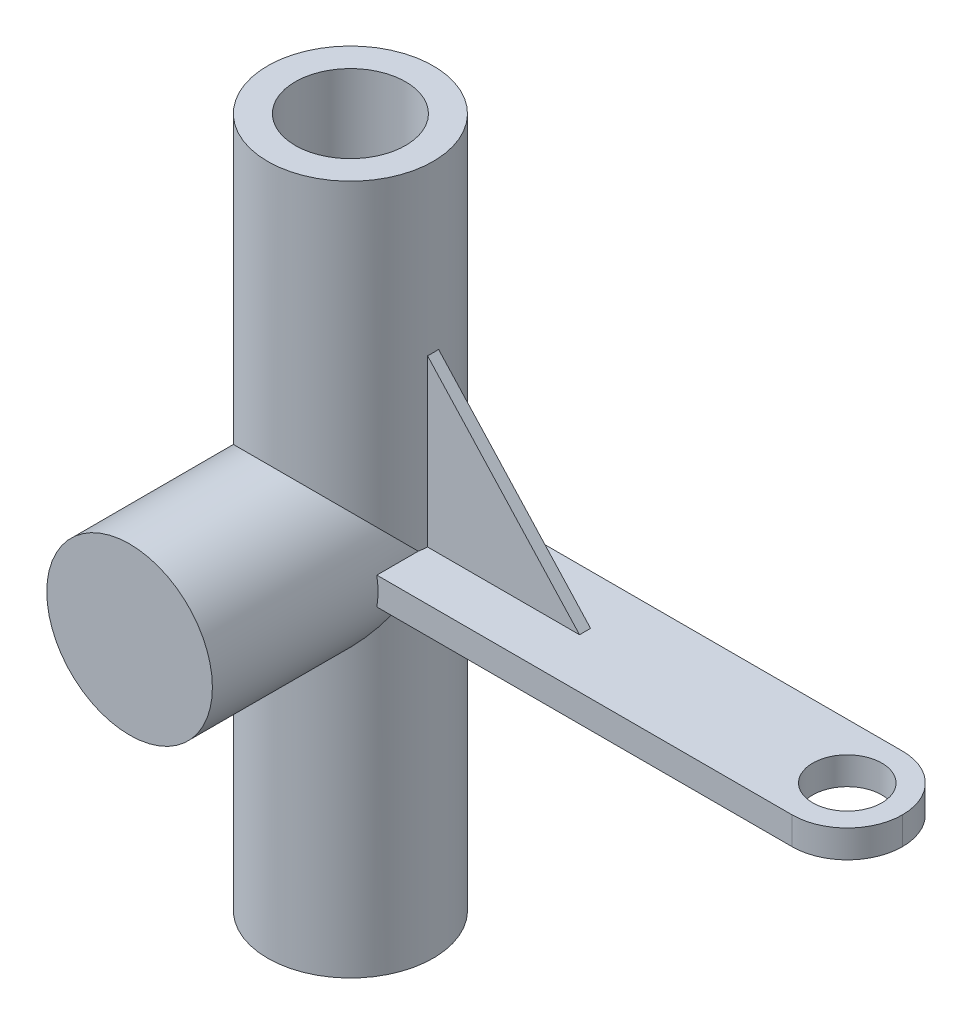
ISO-10303-21;
HEADER;
FILE_DESCRIPTION(('STEP AP214'),'2;1');
FILE_NAME('part.step','',(''),(''),'','','');
FILE_SCHEMA(('AUTOMOTIVE_DESIGN { 1 0 10303 214 1 1 1 1 }'));
ENDSEC;
DATA;
#1=APPLICATION_CONTEXT('core data for automotive mechanical design processes');
#2=APPLICATION_PROTOCOL_DEFINITION('international standard','automotive_design',2000,#1);
#3=PRODUCT_CONTEXT('',#1,'mechanical');
#4=PRODUCT('Part','Part','',(#3));
#5=PRODUCT_RELATED_PRODUCT_CATEGORY('part','',(#4));
#6=PRODUCT_DEFINITION_FORMATION('','',#4);
#7=PRODUCT_DEFINITION_CONTEXT('part definition',#1,'design');
#8=PRODUCT_DEFINITION('design','',#6,#7);
#9=PRODUCT_DEFINITION_SHAPE('','',#8);
#10=(LENGTH_UNIT() NAMED_UNIT(*) SI_UNIT(.MILLI.,.METRE.));
#11=(NAMED_UNIT(*) PLANE_ANGLE_UNIT() SI_UNIT($,.RADIAN.));
#12=(NAMED_UNIT(*) SI_UNIT($,.STERADIAN.) SOLID_ANGLE_UNIT());
#13=UNCERTAINTY_MEASURE_WITH_UNIT(LENGTH_MEASURE(1.E-05),#10,'distance_accuracy_value','');
#14=(GEOMETRIC_REPRESENTATION_CONTEXT(3) GLOBAL_UNCERTAINTY_ASSIGNED_CONTEXT((#13)) GLOBAL_UNIT_ASSIGNED_CONTEXT((#10,
#11,#12)) REPRESENTATION_CONTEXT('',''));
#15=CARTESIAN_POINT('',(0.,0.,0.));
#16=DIRECTION('',(0.,0.,1.));
#17=DIRECTION('',(1.,0.,0.));
#18=AXIS2_PLACEMENT_3D('',#15,#16,#17);
#19=CARTESIAN_POINT('',(0.,125.,0.));
#20=DIRECTION('',(0.,-1.,0.));
#21=DIRECTION('',(0.,0.,-1.));
#22=AXIS2_PLACEMENT_3D('',#19,#20,#21);
#23=CYLINDRICAL_SURFACE('',#22,15.);
#24=CARTESIAN_POINT('',(0.,0.,0.));
#25=DIRECTION('',(0.,1.,0.));
#26=DIRECTION('',(0.,0.,1.));
#27=AXIS2_PLACEMENT_3D('',#24,#25,#26);
#28=CIRCLE('',#27,15.);
#29=CARTESIAN_POINT('',(0.,0.,15.));
#30=VERTEX_POINT('',#29);
#31=EDGE_CURVE('E248',#30,#30,#28,.T.);
#32=ORIENTED_EDGE('',*,*,#31,.T.);
#33=EDGE_LOOP('',(#32));
#34=FACE_BOUND('',#33,.T.);
#35=CARTESIAN_POINT('',(0.,125.,0.));
#36=DIRECTION('',(0.,1.,0.));
#37=DIRECTION('',(0.,0.,1.));
#38=AXIS2_PLACEMENT_3D('',#35,#36,#37);
#39=CIRCLE('',#38,15.);
#40=CARTESIAN_POINT('',(0.,125.,15.));
#41=VERTEX_POINT('',#40);
#42=EDGE_CURVE('E252',#41,#41,#39,.T.);
#43=ORIENTED_EDGE('',*,*,#42,.F.);
#44=EDGE_LOOP('',(#43));
#45=FACE_BOUND('',#44,.T.);
#46=DIRECTION('',(0.,-1.,0.));
#47=VECTOR('',#46,1.);
#48=CARTESIAN_POINT('',(14.9666295470958,125.,-0.999999999999997));
#49=LINE('',#48,#47);
#50=CARTESIAN_POINT('',(14.9666295470958,65.,-0.999999999999997));
#51=VERTEX_POINT('',#50);
#52=CARTESIAN_POINT('',(14.9666295470958,95.,-0.999999999999997));
#53=VERTEX_POINT('',#52);
#54=EDGE_CURVE('E158',#51,#53,#49,.F.);
#55=ORIENTED_EDGE('',*,*,#54,.F.);
#56=CARTESIAN_POINT('',(0.,65.,0.));
#57=DIRECTION('',(0.,-1.,0.));
#58=DIRECTION('',(0.,0.,-1.));
#59=AXIS2_PLACEMENT_3D('',#56,#57,#58);
#60=CIRCLE('',#59,15.);
#61=CARTESIAN_POINT('',(11.180339887499,65.,-10.));
#62=VERTEX_POINT('',#61);
#63=EDGE_CURVE('E165',#62,#51,#60,.T.);
#64=ORIENTED_EDGE('',*,*,#63,.F.);
#65=DIRECTION('',(0.,-1.,0.));
#66=VECTOR('',#65,1.);
#67=CARTESIAN_POINT('',(11.180339887499,125.,-10.));
#68=LINE('',#67,#66);
#69=CARTESIAN_POINT('',(11.180339887499,60.,-10.));
#70=VERTEX_POINT('',#69);
#71=EDGE_CURVE('E223',#70,#62,#68,.F.);
#72=ORIENTED_EDGE('',*,*,#71,.F.);
#73=CARTESIAN_POINT('',(0.,60.,0.));
#74=DIRECTION('',(0.,1.,0.));
#75=DIRECTION('',(0.,0.,1.));
#76=AXIS2_PLACEMENT_3D('',#73,#74,#75);
#77=CIRCLE('',#76,15.);
#78=CARTESIAN_POINT('',(14.7901994577491,60.,2.5));
#79=VERTEX_POINT('',#78);
#80=EDGE_CURVE('E211',#79,#70,#77,.T.);
#81=ORIENTED_EDGE('',*,*,#80,.F.);
#82=CARTESIAN_POINT('',(0.,62.5,0.));
#83=DIRECTION('',(0.,-0.707106781186547,-0.707106781186547));
#84=DIRECTION('',(0.,-0.707106781186547,0.707106781186547));
#85=AXIS2_PLACEMENT_3D('',#82,#83,#84);
#86=ELLIPSE('',#85,21.2132034355964,15.);
#87=CARTESIAN_POINT('',(-15.,62.5,0.));
#88=VERTEX_POINT('',#87);
#89=EDGE_CURVE('E239',#88,#79,#86,.F.);
#90=ORIENTED_EDGE('',*,*,#89,.F.);
#91=CARTESIAN_POINT('',(0.,62.5,0.));
#92=DIRECTION('',(0.,-0.707106781186547,0.707106781186547));
#93=DIRECTION('',(0.,-0.707106781186547,-0.707106781186547));
#94=AXIS2_PLACEMENT_3D('',#91,#92,#93);
#95=ELLIPSE('',#94,21.2132034355964,15.);
#96=CARTESIAN_POINT('',(14.7901994577491,65.,2.5));
#97=VERTEX_POINT('',#96);
#98=EDGE_CURVE('E232',#97,#88,#95,.T.);
#99=ORIENTED_EDGE('',*,*,#98,.F.);
#100=CARTESIAN_POINT('',(14.9666295470958,65.,1.));
#101=VERTEX_POINT('',#100);
#102=EDGE_CURVE('E201',#101,#97,#60,.T.);
#103=ORIENTED_EDGE('',*,*,#102,.F.);
#104=DIRECTION('',(0.,-1.,0.));
#105=VECTOR('',#104,1.);
#106=CARTESIAN_POINT('',(14.9666295470958,125.,1.));
#107=LINE('',#106,#105);
#108=CARTESIAN_POINT('',(14.9666295470958,95.,1.));
#109=VERTEX_POINT('',#108);
#110=EDGE_CURVE('E151',#109,#101,#107,.T.);
#111=ORIENTED_EDGE('',*,*,#110,.F.);
#112=CARTESIAN_POINT('',(0.,95.,0.));
#113=DIRECTION('',(0.,-1.,0.));
#114=DIRECTION('',(0.,0.,-1.));
#115=AXIS2_PLACEMENT_3D('',#112,#113,#114);
#116=CIRCLE('',#115,15.);
#117=EDGE_CURVE('E11',#53,#109,#116,.T.);
#118=ORIENTED_EDGE('',*,*,#117,.F.);
#119=EDGE_LOOP('',(#55,#64,#72,#81,#90,#99,#103,#111,#118));
#120=FACE_BOUND('',#119,.T.);
#121=ADVANCED_FACE('F41',(#34,#45,#120),#23,.T.);
#122=CARTESIAN_POINT('',(100.,65.,10.));
#123=DIRECTION('',(0.,-1.,0.));
#124=DIRECTION('',(0.,0.,-1.));
#125=AXIS2_PLACEMENT_3D('',#122,#123,#124);
#126=PLANE('',#125);
#127=CARTESIAN_POINT('',(90.,65.,0.));
#128=DIRECTION('',(0.,1.,0.));
#129=DIRECTION('',(0.,0.,1.));
#130=AXIS2_PLACEMENT_3D('',#127,#128,#129);
#131=CIRCLE('',#130,6.25);
#132=CARTESIAN_POINT('',(90.,65.,6.25));
#133=VERTEX_POINT('',#132);
#134=EDGE_CURVE('E627',#133,#133,#131,.T.);
#135=ORIENTED_EDGE('',*,*,#134,.F.);
#136=EDGE_LOOP('',(#135));
#137=FACE_BOUND('',#136,.T.);
#138=DIRECTION('',(0.,0.,-1.));
#139=VECTOR('',#138,1.);
#140=CARTESIAN_POINT('',(42.5,65.,-0.999999999999997));
#141=LINE('',#140,#139);
#142=CARTESIAN_POINT('',(42.5,65.,1.));
#143=VERTEX_POINT('',#142);
#144=CARTESIAN_POINT('',(42.5,65.,-0.999999999999997));
#145=VERTEX_POINT('',#144);
#146=EDGE_CURVE('E144',#143,#145,#141,.T.);
#147=ORIENTED_EDGE('',*,*,#146,.F.);
#148=DIRECTION('',(1.,0.,0.));
#149=VECTOR('',#148,1.);
#150=CARTESIAN_POINT('',(100.,65.,1.));
#151=LINE('',#150,#149);
#152=EDGE_CURVE('E51',#101,#143,#151,.T.);
#153=ORIENTED_EDGE('',*,*,#152,.F.);
#154=ORIENTED_EDGE('',*,*,#102,.T.);
#155=DIRECTION('',(0.,0.,-1.));
#156=VECTOR('',#155,1.);
#157=CARTESIAN_POINT('',(14.7901994577491,65.,40.));
#158=LINE('',#157,#156);
#159=CARTESIAN_POINT('',(14.7901994577491,65.,10.));
#160=VERTEX_POINT('',#159);
#161=EDGE_CURVE('E386',#97,#160,#158,.F.);
#162=ORIENTED_EDGE('',*,*,#161,.T.);
#163=DIRECTION('',(-1.,0.,0.));
#164=VECTOR('',#163,1.);
#165=CARTESIAN_POINT('',(100.,65.,10.));
#166=LINE('',#165,#164);
#167=CARTESIAN_POINT('',(90.,65.,10.));
#168=VERTEX_POINT('',#167);
#169=EDGE_CURVE('E189',#168,#160,#166,.T.);
#170=ORIENTED_EDGE('',*,*,#169,.F.);
#171=CARTESIAN_POINT('',(90.,65.,0.));
#172=DIRECTION('',(0.,-1.,0.));
#173=DIRECTION('',(0.,0.,-1.));
#174=AXIS2_PLACEMENT_3D('',#171,#172,#173);
#175=CIRCLE('',#174,10.);
#176=CARTESIAN_POINT('',(100.,65.,0.));
#177=VERTEX_POINT('',#176);
#178=EDGE_CURVE('E400',#168,#177,#175,.F.);
#179=ORIENTED_EDGE('',*,*,#178,.T.);
#180=CARTESIAN_POINT('',(90.,65.,0.));
#181=DIRECTION('',(0.,-1.,0.));
#182=DIRECTION('',(0.,0.,-1.));
#183=AXIS2_PLACEMENT_3D('',#180,#181,#182);
#184=CIRCLE('',#183,10.);
#185=CARTESIAN_POINT('',(90.,65.,-10.));
#186=VERTEX_POINT('',#185);
#187=EDGE_CURVE('E373',#177,#186,#184,.F.);
#188=ORIENTED_EDGE('',*,*,#187,.T.);
#189=DIRECTION('',(-1.,0.,0.));
#190=VECTOR('',#189,1.);
#191=CARTESIAN_POINT('',(100.,65.,-10.));
#192=LINE('',#191,#190);
#193=EDGE_CURVE('E192',#186,#62,#192,.T.);
#194=ORIENTED_EDGE('',*,*,#193,.T.);
#195=ORIENTED_EDGE('',*,*,#63,.T.);
#196=DIRECTION('',(-1.,0.,0.));
#197=VECTOR('',#196,1.);
#198=CARTESIAN_POINT('',(14.5,65.,-0.999999999999997));
#199=LINE('',#198,#197);
#200=EDGE_CURVE('E152',#145,#51,#199,.T.);
#201=ORIENTED_EDGE('',*,*,#200,.F.);
#202=EDGE_LOOP('',(#147,#153,#154,#162,#170,#179,#188,#194,#195,#201));
#203=FACE_BOUND('',#202,.T.);
#204=ADVANCED_FACE('F163',(#137,#203),#126,.F.);
#205=CARTESIAN_POINT('',(0.,125.,0.));
#206=DIRECTION('',(0.,-1.,0.));
#207=DIRECTION('',(0.,0.,-1.));
#208=AXIS2_PLACEMENT_3D('',#205,#206,#207);
#209=CYLINDRICAL_SURFACE('',#208,10.);
#210=CARTESIAN_POINT('',(0.,125.,0.));
#211=DIRECTION('',(0.,1.,0.));
#212=DIRECTION('',(0.,0.,1.));
#213=AXIS2_PLACEMENT_3D('',#210,#211,#212);
#214=CIRCLE('',#213,10.);
#215=CARTESIAN_POINT('',(0.,125.,10.));
#216=VERTEX_POINT('',#215);
#217=EDGE_CURVE('E244',#216,#216,#214,.T.);
#218=ORIENTED_EDGE('',*,*,#217,.T.);
#219=EDGE_LOOP('',(#218));
#220=FACE_BOUND('',#219,.T.);
#221=CARTESIAN_POINT('',(0.,0.,0.));
#222=DIRECTION('',(0.,1.,0.));
#223=DIRECTION('',(0.,0.,1.));
#224=AXIS2_PLACEMENT_3D('',#221,#222,#223);
#225=CIRCLE('',#224,10.);
#226=CARTESIAN_POINT('',(0.,0.,10.));
#227=VERTEX_POINT('',#226);
#228=EDGE_CURVE('E243',#227,#227,#225,.T.);
#229=ORIENTED_EDGE('',*,*,#228,.F.);
#230=EDGE_LOOP('',(#229));
#231=FACE_BOUND('',#230,.T.);
#232=DIRECTION('',(0.,-1.,0.));
#233=VECTOR('',#232,1.);
#234=CARTESIAN_POINT('',(10.,125.,0.));
#235=LINE('',#234,#233);
#236=CARTESIAN_POINT('',(10.,51.319660112501,0.));
#237=VERTEX_POINT('',#236);
#238=CARTESIAN_POINT('',(10.,60.,0.));
#239=VERTEX_POINT('',#238);
#240=EDGE_CURVE('E260',#237,#239,#235,.F.);
#241=ORIENTED_EDGE('',*,*,#240,.T.);
#242=CARTESIAN_POINT('',(0.,60.,0.));
#243=DIRECTION('',(0.,1.,0.));
#244=DIRECTION('',(0.,0.,1.));
#245=AXIS2_PLACEMENT_3D('',#242,#243,#244);
#246=CIRCLE('',#245,10.);
#247=CARTESIAN_POINT('',(0.,60.,-10.));
#248=VERTEX_POINT('',#247);
#249=EDGE_CURVE('E219',#239,#248,#246,.T.);
#250=ORIENTED_EDGE('',*,*,#249,.T.);
#251=DIRECTION('',(0.,1.,0.));
#252=VECTOR('',#251,1.);
#253=CARTESIAN_POINT('',(0.,65.,-10.));
#254=LINE('',#253,#252);
#255=CARTESIAN_POINT('',(0.,65.,-10.));
#256=VERTEX_POINT('',#255);
#257=EDGE_CURVE('E181',#248,#256,#254,.T.);
#258=ORIENTED_EDGE('',*,*,#257,.T.);
#259=CARTESIAN_POINT('',(0.,65.,0.));
#260=DIRECTION('',(0.,-1.,0.));
#261=DIRECTION('',(0.,0.,-1.));
#262=AXIS2_PLACEMENT_3D('',#259,#260,#261);
#263=CIRCLE('',#262,10.);
#264=CARTESIAN_POINT('',(10.,65.,0.));
#265=VERTEX_POINT('',#264);
#266=EDGE_CURVE('E207',#256,#265,#263,.T.);
#267=ORIENTED_EDGE('',*,*,#266,.T.);
#268=CARTESIAN_POINT('',(10.,73.680339887499,0.));
#269=VERTEX_POINT('',#268);
#270=EDGE_CURVE('E256',#265,#269,#235,.F.);
#271=ORIENTED_EDGE('',*,*,#270,.T.);
#272=CARTESIAN_POINT('',(10.,73.680339887499,0.));
#273=CARTESIAN_POINT('',(10.0000019662644,73.6803341285554,0.122908083291886));
#274=CARTESIAN_POINT('',(9.99773339672962,73.6823676522141,0.245795438662537));
#275=CARTESIAN_POINT('',(9.98868075195431,73.6904562528802,0.491259157771999));
#276=CARTESIAN_POINT('',(9.98189712810506,73.696510927874,0.613835551369558));
#277=CARTESIAN_POINT('',(9.95484008556213,73.7205962021832,0.980341470499923));
#278=CARTESIAN_POINT('',(9.92786031801123,73.7445484143372,1.22344075436707));
#279=CARTESIAN_POINT('',(9.85692199140147,73.8067794801167,1.70271606910721));
#280=CARTESIAN_POINT('',(9.81313360307206,73.8449146287484,1.93893674586963));
#281=CARTESIAN_POINT('',(9.70933595979469,73.9338733583765,2.40539084014844));
#282=CARTESIAN_POINT('',(9.64932198669643,73.9847006297179,2.63562249476913));
#283=CARTESIAN_POINT('',(9.51430209888207,74.0967965567622,3.08762076307501));
#284=CARTESIAN_POINT('',(9.43937638209315,74.1580091094161,3.30942540898784));
#285=CARTESIAN_POINT('',(9.27521238204891,74.2890411827064,3.7449468087664));
#286=CARTESIAN_POINT('',(9.18597482688439,74.3588602654582,3.95866397338595));
#287=CARTESIAN_POINT('',(8.89735329466268,74.5787194524851,4.58807557587278));
#288=CARTESIAN_POINT('',(8.67735629737759,74.7389043780612,4.99105544505011));
#289=CARTESIAN_POINT('',(8.29129524792107,75.0013515100962,5.5967548522808));
#290=CARTESIAN_POINT('',(8.1417020470214,75.0994998696131,5.81216410863114));
#291=CARTESIAN_POINT('',(7.82649231833529,75.2976804602117,6.23012673255034));
#292=CARTESIAN_POINT('',(7.66087472678606,75.397712816005,6.43267924515728));
#293=CARTESIAN_POINT('',(7.31418209262196,75.5974342938179,6.82430658353011));
#294=CARTESIAN_POINT('',(7.13310489225783,75.6971233658976,7.01337952112643));
#295=CARTESIAN_POINT('',(6.75590366095745,75.8941428962359,7.37743148512814));
#296=CARTESIAN_POINT('',(6.55977230733853,75.9914721759597,7.55240356663883));
#297=CARTESIAN_POINT('',(6.12350040303769,76.1955771283599,7.91162090637637));
#298=CARTESIAN_POINT('',(5.88110397785951,76.3016735607452,8.09352620425259));
#299=CARTESIAN_POINT('',(5.37841190890662,76.5052195059547,8.43594148342966));
#300=CARTESIAN_POINT('',(5.11812584836926,76.6026735852692,8.59646278650464));
#301=CARTESIAN_POINT('',(4.58092530474232,76.7862046380633,8.89434642230069));
#302=CARTESIAN_POINT('',(4.30401783641956,76.8722863626223,9.03171843285677));
#303=CARTESIAN_POINT('',(3.73529722016773,77.0304715239106,9.28137561061249));
#304=CARTESIAN_POINT('',(3.44348728334321,77.1025779560387,9.39366615444473));
#305=CARTESIAN_POINT('',(2.88082821284893,77.223250182534,9.58011233592227));
#306=CARTESIAN_POINT('',(2.61129919972898,77.2735492311711,9.65713262962674));
#307=CARTESIAN_POINT('',(2.0645294229625,77.3598209230397,9.78860280762323));
#308=CARTESIAN_POINT('',(1.78728918107016,77.3957945330429,9.84305421501748));
#309=CARTESIAN_POINT('',(1.22793917300902,77.4522941504247,9.92834932789231));
#310=CARTESIAN_POINT('',(0.945834860668397,77.4728364372598,9.95921791293619));
#311=CARTESIAN_POINT('',(0.379327505846204,77.4978816841611,9.99683241551685));
#312=CARTESIAN_POINT('',(0.0949247933797898,77.50238690729,10.0035817366327));
#313=CARTESIAN_POINT('',(-0.429890333129019,77.4957738621773,9.99365946293529));
#314=CARTESIAN_POINT('',(-0.670405430373815,77.4869306305415,9.98039843933322));
#315=CARTESIAN_POINT('',(-1.14916934748078,77.4578376542313,9.93665826160711));
#316=CARTESIAN_POINT('',(-1.38741821686984,77.4375881594182,9.90617948464865));
#317=CARTESIAN_POINT('',(-1.8599416134959,77.3861382030705,9.82842601275427));
#318=CARTESIAN_POINT('',(-2.09421618238097,77.3549378563681,9.78115149394085));
#319=CARTESIAN_POINT('',(-2.55727839003123,77.2822617118014,9.67041909157562));
#320=CARTESIAN_POINT('',(-2.78606579121632,77.2407854698954,9.60696050867491));
#321=CARTESIAN_POINT('',(-3.23586004110859,77.1486073470994,9.46491433929526));
#322=CARTESIAN_POINT('',(-3.45689579211393,77.0979453708846,9.38639210985778));
#323=CARTESIAN_POINT('',(-3.89118343175868,76.9882323039131,9.21483719709088));
#324=CARTESIAN_POINT('',(-4.1044327303078,76.9291784530634,9.1217997387039));
#325=CARTESIAN_POINT('',(-4.52213359273533,76.8037704642793,8.9221009894455));
#326=CARTESIAN_POINT('',(-4.72658750024245,76.7374182880364,8.81544335825792));
#327=CARTESIAN_POINT('',(-5.12613026843352,76.598494483268,8.58926728521921));
#328=CARTESIAN_POINT('',(-5.32121574797326,76.5259206352202,8.46974424983818));
#329=CARTESIAN_POINT('',(-5.72633078565189,76.3658779971488,8.20216646387367));
#330=CARTESIAN_POINT('',(-5.93496872233939,76.2777035729189,8.05242530391318));
#331=CARTESIAN_POINT('',(-6.33894603460613,76.0965729756602,7.73842700250566));
#332=CARTESIAN_POINT('',(-6.53427941602822,76.0036146800134,7.57416339378907));
#333=CARTESIAN_POINT('',(-6.91132960510199,75.8145806026907,7.23176778878176));
#334=CARTESIAN_POINT('',(-7.09302687376191,75.7185006199906,7.05361661073946));
#335=CARTESIAN_POINT('',(-7.44198959608793,75.5252280827419,6.68440712720149));
#336=CARTESIAN_POINT('',(-7.60925973806327,75.4280359013365,6.49335305095354));
#337=CARTESIAN_POINT('',(-7.95384735185595,75.2193915728319,6.06814596506085));
#338=CARTESIAN_POINT('',(-8.12868447910812,75.1080713984021,5.83191005670115));
#339=CARTESIAN_POINT('',(-8.45775206098623,74.8897309634299,5.34351489749032));
#340=CARTESIAN_POINT('',(-8.61197769657105,74.7827117125346,5.09135194306177));
#341=CARTESIAN_POINT('',(-8.89853128768456,74.5767233207896,4.57208818968848));
#342=CARTESIAN_POINT('',(-9.03088152717082,74.477746040699,4.30500296758524));
#343=CARTESIAN_POINT('',(-9.27240645990513,74.2917648681875,3.75661281001167));
#344=CARTESIAN_POINT('',(-9.38159284001154,74.2047549457079,3.47531513427528));
#345=CARTESIAN_POINT('',(-9.54801158638537,74.0690778214802,2.9804793272992));
#346=CARTESIAN_POINT('',(-9.61123177037526,74.0164952118853,2.770013403874));
#347=CARTESIAN_POINT('',(-9.72408164930214,73.9213698799914,2.34326880833405));
#348=CARTESIAN_POINT('',(-9.77371524585155,73.878824275887,2.12699182459367));
#349=CARTESIAN_POINT('',(-9.85861049231009,73.8053505181962,1.69030911284007));
#350=CARTESIAN_POINT('',(-9.89391085780338,73.7743910871009,1.46991621176618));
#351=CARTESIAN_POINT('',(-9.94974461286417,73.7251497436318,1.02594789295992));
#352=CARTESIAN_POINT('',(-9.97028723032151,73.7068599093269,0.802374553285027));
#353=CARTESIAN_POINT('',(-9.98884716882532,73.6903071254827,0.481904573199954));
#354=CARTESIAN_POINT('',(-9.99302852832223,73.6865722173172,0.385592968518363));
#355=CARTESIAN_POINT('',(-9.99860456831422,73.6815883268953,0.192858527287807));
#356=CARTESIAN_POINT('',(-10.0000002177439,73.6803384802772,0.0964357410905486));
#357=CARTESIAN_POINT('',(-10.,73.6803398874989,0.));
#358=B_SPLINE_CURVE_WITH_KNOTS('',3,(#272,#273,#274,#275,#276,#277,#278,#279,#280,#281,#282,
#283,#284,#285,#286,#287,#288,#289,#290,#291,#292,#293,#294,#295,#296,#297,#298,#299,#300,#301,
#302,#303,#304,#305,#306,#307,#308,#309,#310,#311,#312,#313,#314,#315,#316,#317,#318,#319,#320,
#321,#322,#323,#324,#325,#326,#327,#328,#329,#330,#331,#332,#333,#334,#335,#336,#337,#338,#339,
#340,#341,#342,#343,#344,#345,#346,#347,#348,#349,#350,#351,#352,#353,#354,#355,#356,#357),
.UNSPECIFIED.,.F.,.F.,(4,2,2,2,2,2,2,2,2,2,2,2,2,2,2,2,2,2,2,2,2,2,2,2,2,2,2,2,2,2,2,2,2,2,2,2,
2,2,2,2,2,2,4),(0.,0.368646050186405,0.737255250621696,1.47329974643748,2.20208108990007,
2.93107458010895,3.65624850314492,4.38138554586728,5.83478174144707,6.6742647519412,
7.51380352894201,8.35345967533995,9.19352686995975,10.1555208892916,11.1170035384646,
12.0780832258629,13.0389566915795,13.8920552544146,14.745096234968,15.5972360211362,
16.4492555532334,17.1715077978443,17.8937442216846,18.6159730722762,19.3382331372499,
20.0574276279281,20.7768592119827,21.4960978929086,22.2155942317108,23.0293731080495,
23.8435162270739,24.658804488051,25.4738268028542,26.4155476148543,27.3574882208219,
28.2984632997486,29.2389624936457,29.9162147428955,30.5932723034906,31.2684886948951,
31.9432825110777,32.2326465857274,32.5219099952884),.UNSPECIFIED.);
#359=CARTESIAN_POINT('',(-10.,73.6803398874989,0.));
#360=VERTEX_POINT('',#359);
#361=EDGE_CURVE('E274',#269,#360,#358,.T.);
#362=ORIENTED_EDGE('',*,*,#361,.T.);
#363=DIRECTION('',(0.,-1.,0.));
#364=VECTOR('',#363,1.);
#365=CARTESIAN_POINT('',(-10.,125.,0.));
#366=LINE('',#365,#364);
#367=CARTESIAN_POINT('',(-10.,51.3196601125011,0.));
#368=VERTEX_POINT('',#367);
#369=EDGE_CURVE('E413',#360,#368,#366,.T.);
#370=ORIENTED_EDGE('',*,*,#369,.T.);
#371=CARTESIAN_POINT('',(-10.,51.3196601125011,0.));
#372=CARTESIAN_POINT('',(-10.0000019662644,51.3196658714447,0.122908083291886));
#373=CARTESIAN_POINT('',(-9.99773339672962,51.317632347786,0.245795438662537));
#374=CARTESIAN_POINT('',(-9.98868075195431,51.3095437471198,0.491259157771998));
#375=CARTESIAN_POINT('',(-9.98189712810506,51.303489072126,0.613835551369557));
#376=CARTESIAN_POINT('',(-9.95484008556213,51.2794037978168,0.980341470499922));
#377=CARTESIAN_POINT('',(-9.92786031801124,51.2554515856628,1.22344075436707));
#378=CARTESIAN_POINT('',(-9.85692199140147,51.1932205198833,1.70271606910721));
#379=CARTESIAN_POINT('',(-9.81313360307206,51.1550853712516,1.93893674586963));
#380=CARTESIAN_POINT('',(-9.70933595979468,51.0661266416235,2.40539084014844));
#381=CARTESIAN_POINT('',(-9.64932198669643,51.0152993702822,2.63562249476913));
#382=CARTESIAN_POINT('',(-9.51430209888207,50.9032034432379,3.087620763075));
#383=CARTESIAN_POINT('',(-9.43937638209315,50.8419908905839,3.30942540898784));
#384=CARTESIAN_POINT('',(-9.27521238204891,50.7109588172936,3.74494680876639));
#385=CARTESIAN_POINT('',(-9.18597482688439,50.6411397345419,3.95866397338595));
#386=CARTESIAN_POINT('',(-8.89735329466268,50.4212805475149,4.58807557587278));
#387=CARTESIAN_POINT('',(-8.67735629737759,50.2610956219389,4.9910554450501));
#388=CARTESIAN_POINT('',(-8.29129524792108,49.9986484899039,5.59675485228079));
#389=CARTESIAN_POINT('',(-8.14170204702141,49.9005001303869,5.81216410863114));
#390=CARTESIAN_POINT('',(-7.8264923183353,49.7023195397884,6.23012673255034));
#391=CARTESIAN_POINT('',(-7.66087472678607,49.6022871839951,6.43267924515728));
#392=CARTESIAN_POINT('',(-7.31418209262197,49.4025657061821,6.8243065835301));
#393=CARTESIAN_POINT('',(-7.13310489225784,49.3028766341024,7.01337952112642));
#394=CARTESIAN_POINT('',(-6.75590366095745,49.1058571037641,7.37743148512813));
#395=CARTESIAN_POINT('',(-6.55977230733853,49.0085278240403,7.55240356663882));
#396=CARTESIAN_POINT('',(-6.1235004030377,48.8044228716401,7.91162090637637));
#397=CARTESIAN_POINT('',(-5.88110397785953,48.6983264392548,8.09352620425258));
#398=CARTESIAN_POINT('',(-5.37841190890663,48.4947804940454,8.43594148342965));
#399=CARTESIAN_POINT('',(-5.11812584836927,48.3973264147308,8.59646278650463));
#400=CARTESIAN_POINT('',(-4.58092530474233,48.2137953619367,8.89434642230069));
#401=CARTESIAN_POINT('',(-4.30401783641957,48.1277136373777,9.03171843285677));
#402=CARTESIAN_POINT('',(-3.73529722016774,47.9695284760894,9.28137561061249));
#403=CARTESIAN_POINT('',(-3.44348728334322,47.8974220439613,9.39366615444472));
#404=CARTESIAN_POINT('',(-2.88082821284894,47.776749817466,9.58011233592226));
#405=CARTESIAN_POINT('',(-2.61129919972899,47.7264507688289,9.65713262962674));
#406=CARTESIAN_POINT('',(-2.06452942296251,47.6401790769603,9.78860280762323));
#407=CARTESIAN_POINT('',(-1.78728918107017,47.6042054669571,9.84305421501748));
#408=CARTESIAN_POINT('',(-1.22793917300903,47.5477058495753,9.9283493278923));
#409=CARTESIAN_POINT('',(-0.945834860668403,47.5271635627402,9.95921791293619));
#410=CARTESIAN_POINT('',(-0.379327505846209,47.5021183158389,9.99683241551685));
#411=CARTESIAN_POINT('',(-0.0949247933797949,47.49761309271,10.0035817366327));
#412=CARTESIAN_POINT('',(0.429890333129016,47.5042261378227,9.99365946293529));
#413=CARTESIAN_POINT('',(0.670405430373814,47.5130693694585,9.98039843933322));
#414=CARTESIAN_POINT('',(1.14916934748078,47.5421623457687,9.93665826160711));
#415=CARTESIAN_POINT('',(1.38741821686984,47.5624118405818,9.90617948464865));
#416=CARTESIAN_POINT('',(1.8599416134959,47.6138617969295,9.82842601275427));
#417=CARTESIAN_POINT('',(2.09421618238097,47.6450621436319,9.78115149394085));
#418=CARTESIAN_POINT('',(2.55727839003123,47.7177382881986,9.67041909157562));
#419=CARTESIAN_POINT('',(2.78606579121632,47.7592145301046,9.60696050867492));
#420=CARTESIAN_POINT('',(3.23586004110859,47.8513926529006,9.46491433929526));
#421=CARTESIAN_POINT('',(3.45689579211392,47.9020546291154,9.38639210985778));
#422=CARTESIAN_POINT('',(3.89118343175868,48.0117676960869,9.21483719709089));
#423=CARTESIAN_POINT('',(4.10443273030779,48.0708215469366,9.1217997387039));
#424=CARTESIAN_POINT('',(4.52213359273532,48.1962295357207,8.9221009894455));
#425=CARTESIAN_POINT('',(4.72658750024244,48.2625817119636,8.81544335825793));
#426=CARTESIAN_POINT('',(5.12613026843351,48.4015055167319,8.58926728521922));
#427=CARTESIAN_POINT('',(5.32121574797326,48.4740793647797,8.46974424983818));
#428=CARTESIAN_POINT('',(5.72633078565189,48.6341220028511,8.20216646387367));
#429=CARTESIAN_POINT('',(5.93496872233939,48.7222964270811,8.05242530391319));
#430=CARTESIAN_POINT('',(6.33894603460612,48.9034270243398,7.73842700250566));
#431=CARTESIAN_POINT('',(6.53427941602821,48.9963853199866,7.57416339378907));
#432=CARTESIAN_POINT('',(6.91132960510199,49.1854193973092,7.23176778878176));
#433=CARTESIAN_POINT('',(7.09302687376191,49.2814993800093,7.05361661073946));
#434=CARTESIAN_POINT('',(7.44198959608793,49.4747719172581,6.68440712720149));
#435=CARTESIAN_POINT('',(7.60925973806327,49.5719640986635,6.49335305095354));
#436=CARTESIAN_POINT('',(7.95384735185595,49.7806084271681,6.06814596506086));
#437=CARTESIAN_POINT('',(8.12868447910812,49.8919286015979,5.83191005670115));
#438=CARTESIAN_POINT('',(8.45775206098623,50.1102690365701,5.34351489749032));
#439=CARTESIAN_POINT('',(8.61197769657104,50.2172882874654,5.09135194306177));
#440=CARTESIAN_POINT('',(8.89853128768456,50.4232766792103,4.57208818968848));
#441=CARTESIAN_POINT('',(9.03088152717082,50.5222539593009,4.30500296758524));
#442=CARTESIAN_POINT('',(9.27240645990512,50.7082351318125,3.75661281001168));
#443=CARTESIAN_POINT('',(9.38159284001154,50.7952450542921,3.47531513427529));
#444=CARTESIAN_POINT('',(9.54801158638536,50.9309221785198,2.9804793272992));
#445=CARTESIAN_POINT('',(9.61123177037526,50.9835047881147,2.770013403874));
#446=CARTESIAN_POINT('',(9.72408164930214,51.0786301200085,2.34326880833406));
#447=CARTESIAN_POINT('',(9.77371524585155,51.121175724113,2.12699182459367));
#448=CARTESIAN_POINT('',(9.85861049231008,51.1946494818038,1.69030911284007));
#449=CARTESIAN_POINT('',(9.89391085780338,51.2256089128991,1.46991621176618));
#450=CARTESIAN_POINT('',(9.94974461286417,51.2748502563682,1.02594789295992));
#451=CARTESIAN_POINT('',(9.97028723032151,51.2931400906731,0.802374553285026));
#452=CARTESIAN_POINT('',(9.98884716882532,51.3096928745173,0.481904573199954));
#453=CARTESIAN_POINT('',(9.99302852832223,51.3134277826827,0.385592968518363));
#454=CARTESIAN_POINT('',(9.99860456831422,51.3184116731047,0.192858527287807));
#455=CARTESIAN_POINT('',(10.0000002177439,51.3196615197227,0.0964357410905487));
#456=CARTESIAN_POINT('',(10.,51.319660112501,0.));
#457=B_SPLINE_CURVE_WITH_KNOTS('',3,(#371,#372,#373,#374,#375,#376,#377,#378,#379,#380,#381,
#382,#383,#384,#385,#386,#387,#388,#389,#390,#391,#392,#393,#394,#395,#396,#397,#398,#399,#400,
#401,#402,#403,#404,#405,#406,#407,#408,#409,#410,#411,#412,#413,#414,#415,#416,#417,#418,#419,
#420,#421,#422,#423,#424,#425,#426,#427,#428,#429,#430,#431,#432,#433,#434,#435,#436,#437,#438,
#439,#440,#441,#442,#443,#444,#445,#446,#447,#448,#449,#450,#451,#452,#453,#454,#455,#456),
.UNSPECIFIED.,.F.,.F.,(4,2,2,2,2,2,2,2,2,2,2,2,2,2,2,2,2,2,2,2,2,2,2,2,2,2,2,2,2,2,2,2,2,2,2,2,
2,2,2,2,2,2,4),(0.,0.368646050186405,0.737255250621695,1.47329974643748,2.20208108990007,
2.93107458010894,3.65624850314492,4.38138554586728,5.83478174144706,6.6742647519412,
7.51380352894201,8.35345967533995,9.19352686995974,10.1555208892916,11.1170035384646,
12.0780832258629,13.0389566915795,13.8920552544146,14.745096234968,15.5972360211362,
16.4492555532334,17.1715077978443,17.8937442216846,18.6159730722762,19.3382331372499,
20.0574276279282,20.7768592119827,21.4960978929086,22.2155942317108,23.0293731080495,
23.8435162270739,24.658804488051,25.4738268028542,26.4155476148543,27.3574882208219,
28.2984632997486,29.2389624936457,29.9162147428955,30.5932723034906,31.2684886948951,
31.9432825110777,32.2326465857274,32.5219099952884),.UNSPECIFIED.);
#458=EDGE_CURVE('E264',#368,#237,#457,.T.);
#459=ORIENTED_EDGE('',*,*,#458,.T.);
#460=EDGE_LOOP('',(#241,#250,#258,#267,#271,#362,#370,#459));
#461=FACE_BOUND('',#460,.T.);
#462=ADVANCED_FACE('F280',(#220,#231,#461),#209,.F.);
#463=CARTESIAN_POINT('',(0.,62.5,0.));
#464=DIRECTION('',(0.,0.,1.));
#465=DIRECTION('',(1.,0.,0.));
#466=AXIS2_PLACEMENT_3D('',#463,#464,#465);
#467=PLANE('',#466);
#468=DIRECTION('',(-1.,0.,0.));
#469=VECTOR('',#468,1.);
#470=CARTESIAN_POINT('',(0.,60.,0.));
#471=LINE('',#470,#469);
#472=CARTESIAN_POINT('',(0.,60.,0.));
#473=VERTEX_POINT('',#472);
#474=EDGE_CURVE('E215',#239,#473,#471,.T.);
#475=ORIENTED_EDGE('',*,*,#474,.F.);
#476=ORIENTED_EDGE('',*,*,#240,.F.);
#477=CARTESIAN_POINT('',(0.,62.5,0.));
#478=DIRECTION('',(0.,0.,1.));
#479=DIRECTION('',(1.,0.,0.));
#480=AXIS2_PLACEMENT_3D('',#477,#478,#479);
#481=CIRCLE('',#480,15.);
#482=EDGE_CURVE('E227',#368,#237,#481,.T.);
#483=ORIENTED_EDGE('',*,*,#482,.F.);
#484=ORIENTED_EDGE('',*,*,#369,.F.);
#485=EDGE_CURVE('E233',#269,#360,#481,.T.);
#486=ORIENTED_EDGE('',*,*,#485,.F.);
#487=ORIENTED_EDGE('',*,*,#270,.F.);
#488=DIRECTION('',(1.,0.,0.));
#489=VECTOR('',#488,1.);
#490=CARTESIAN_POINT('',(0.,65.,0.));
#491=LINE('',#490,#489);
#492=CARTESIAN_POINT('',(0.,65.,0.));
#493=VERTEX_POINT('',#492);
#494=EDGE_CURVE('E204',#493,#265,#491,.T.);
#495=ORIENTED_EDGE('',*,*,#494,.F.);
#496=DIRECTION('',(0.,-1.,0.));
#497=VECTOR('',#496,1.);
#498=CARTESIAN_POINT('',(0.,62.5,0.));
#499=LINE('',#498,#497);
#500=EDGE_CURVE('E403',#493,#473,#499,.T.);
#501=ORIENTED_EDGE('',*,*,#500,.T.);
#502=EDGE_LOOP('',(#475,#476,#483,#484,#486,#487,#495,#501));
#503=FACE_BOUND('',#502,.T.);
#504=ADVANCED_FACE('F291',(#503),#467,.F.);
#505=CARTESIAN_POINT('',(0.,62.5,40.));
#506=DIRECTION('',(0.,0.,-1.));
#507=DIRECTION('',(-1.,0.,0.));
#508=AXIS2_PLACEMENT_3D('',#505,#506,#507);
#509=CYLINDRICAL_SURFACE('',#508,15.);
#510=CARTESIAN_POINT('',(0.,62.5,40.));
#511=DIRECTION('',(0.,0.,1.));
#512=DIRECTION('',(1.,0.,0.));
#513=AXIS2_PLACEMENT_3D('',#510,#511,#512);
#514=CIRCLE('',#513,15.);
#515=CARTESIAN_POINT('',(15.,62.5,40.));
#516=VERTEX_POINT('',#515);
#517=EDGE_CURVE('E228',#516,#516,#514,.T.);
#518=ORIENTED_EDGE('',*,*,#517,.F.);
#519=EDGE_LOOP('',(#518));
#520=FACE_BOUND('',#519,.T.);
#521=DIRECTION('',(0.,0.,-1.));
#522=VECTOR('',#521,1.);
#523=CARTESIAN_POINT('',(14.7901994577491,60.,40.));
#524=LINE('',#523,#522);
#525=CARTESIAN_POINT('',(14.7901994577491,60.,10.));
#526=VERTEX_POINT('',#525);
#527=EDGE_CURVE('E377',#526,#79,#524,.T.);
#528=ORIENTED_EDGE('',*,*,#527,.F.);
#529=CARTESIAN_POINT('',(0.,62.5,10.));
#530=DIRECTION('',(0.,0.,-1.));
#531=DIRECTION('',(-1.,0.,0.));
#532=AXIS2_PLACEMENT_3D('',#529,#530,#531);
#533=CIRCLE('',#532,15.);
#534=EDGE_CURVE('E409',#160,#526,#533,.T.);
#535=ORIENTED_EDGE('',*,*,#534,.F.);
#536=ORIENTED_EDGE('',*,*,#161,.F.);
#537=ORIENTED_EDGE('',*,*,#98,.T.);
#538=ORIENTED_EDGE('',*,*,#89,.T.);
#539=EDGE_LOOP('',(#528,#535,#536,#537,#538));
#540=FACE_BOUND('',#539,.T.);
#541=ADVANCED_FACE('F290',(#520,#540),#509,.T.);
#542=CARTESIAN_POINT('',(0.,125.,0.));
#543=DIRECTION('',(0.,1.,0.));
#544=DIRECTION('',(0.,0.,1.));
#545=AXIS2_PLACEMENT_3D('',#542,#543,#544);
#546=PLANE('',#545);
#547=ORIENTED_EDGE('',*,*,#42,.T.);
#548=EDGE_LOOP('',(#547));
#549=FACE_BOUND('',#548,.T.);
#550=ORIENTED_EDGE('',*,*,#217,.F.);
#551=EDGE_LOOP('',(#550));
#552=FACE_BOUND('',#551,.T.);
#553=ADVANCED_FACE('F435',(#549,#552),#546,.T.);
#554=CARTESIAN_POINT('',(0.,0.,0.));
#555=DIRECTION('',(0.,1.,0.));
#556=DIRECTION('',(0.,0.,1.));
#557=AXIS2_PLACEMENT_3D('',#554,#555,#556);
#558=PLANE('',#557);
#559=ORIENTED_EDGE('',*,*,#31,.F.);
#560=EDGE_LOOP('',(#559));
#561=FACE_BOUND('',#560,.T.);
#562=ORIENTED_EDGE('',*,*,#228,.T.);
#563=EDGE_LOOP('',(#562));
#564=FACE_BOUND('',#563,.T.);
#565=ADVANCED_FACE('F288',(#561,#564),#558,.F.);
#566=ORIENTED_EDGE('',*,*,#458,.F.);
#567=ORIENTED_EDGE('',*,*,#482,.T.);
#568=EDGE_LOOP('',(#566,#567));
#569=FACE_BOUND('',#568,.T.);
#570=ADVANCED_FACE('F283',(#569),#509,.T.);
#571=ORIENTED_EDGE('',*,*,#361,.F.);
#572=ORIENTED_EDGE('',*,*,#485,.T.);
#573=EDGE_LOOP('',(#571,#572));
#574=FACE_BOUND('',#573,.T.);
#575=ADVANCED_FACE('F287',(#574),#509,.T.);
#576=CARTESIAN_POINT('',(0.,62.5,40.));
#577=DIRECTION('',(0.,0.,1.));
#578=DIRECTION('',(1.,0.,0.));
#579=AXIS2_PLACEMENT_3D('',#576,#577,#578);
#580=PLANE('',#579);
#581=ORIENTED_EDGE('',*,*,#517,.T.);
#582=EDGE_LOOP('',(#581));
#583=FACE_BOUND('',#582,.T.);
#584=ADVANCED_FACE('F296',(#583),#580,.T.);
#585=CARTESIAN_POINT('',(100.,60.,10.));
#586=DIRECTION('',(0.,0.,-1.));
#587=DIRECTION('',(-1.,0.,0.));
#588=AXIS2_PLACEMENT_3D('',#585,#586,#587);
#589=PLANE('',#588);
#590=DIRECTION('',(-1.,0.,0.));
#591=VECTOR('',#590,1.);
#592=CARTESIAN_POINT('',(100.,60.,10.));
#593=LINE('',#592,#591);
#594=CARTESIAN_POINT('',(90.,60.,10.));
#595=VERTEX_POINT('',#594);
#596=EDGE_CURVE('E198',#595,#526,#593,.T.);
#597=ORIENTED_EDGE('',*,*,#596,.F.);
#598=DIRECTION('',(0.,-1.,0.));
#599=VECTOR('',#598,1.);
#600=CARTESIAN_POINT('',(90.,60.,10.));
#601=LINE('',#600,#599);
#602=EDGE_CURVE('E367',#595,#168,#601,.F.);
#603=ORIENTED_EDGE('',*,*,#602,.T.);
#604=ORIENTED_EDGE('',*,*,#169,.T.);
#605=ORIENTED_EDGE('',*,*,#534,.T.);
#606=EDGE_LOOP('',(#597,#603,#604,#605));
#607=FACE_BOUND('',#606,.T.);
#608=ADVANCED_FACE('F299',(#607),#589,.F.);
#609=CARTESIAN_POINT('',(100.,60.,-10.));
#610=DIRECTION('',(0.,1.,0.));
#611=DIRECTION('',(0.,0.,1.));
#612=AXIS2_PLACEMENT_3D('',#609,#610,#611);
#613=PLANE('',#612);
#614=CARTESIAN_POINT('',(90.,60.,0.));
#615=DIRECTION('',(0.,1.,0.));
#616=DIRECTION('',(0.,0.,1.));
#617=AXIS2_PLACEMENT_3D('',#614,#615,#616);
#618=CIRCLE('',#617,6.25);
#619=CARTESIAN_POINT('',(90.,60.,6.25));
#620=VERTEX_POINT('',#619);
#621=EDGE_CURVE('E45',#620,#620,#618,.T.);
#622=ORIENTED_EDGE('',*,*,#621,.T.);
#623=EDGE_LOOP('',(#622));
#624=FACE_BOUND('',#623,.T.);
#625=DIRECTION('',(-1.,0.,0.));
#626=VECTOR('',#625,1.);
#627=CARTESIAN_POINT('',(100.,60.,-10.));
#628=LINE('',#627,#626);
#629=CARTESIAN_POINT('',(90.,60.,-10.));
#630=VERTEX_POINT('',#629);
#631=EDGE_CURVE('E195',#630,#70,#628,.T.);
#632=ORIENTED_EDGE('',*,*,#631,.F.);
#633=CARTESIAN_POINT('',(90.,60.,0.));
#634=DIRECTION('',(0.,1.,0.));
#635=DIRECTION('',(0.,0.,1.));
#636=AXIS2_PLACEMENT_3D('',#633,#634,#635);
#637=CIRCLE('',#636,10.);
#638=CARTESIAN_POINT('',(100.,60.,0.));
#639=VERTEX_POINT('',#638);
#640=EDGE_CURVE('E358',#630,#639,#637,.F.);
#641=ORIENTED_EDGE('',*,*,#640,.T.);
#642=CARTESIAN_POINT('',(90.,60.,0.));
#643=DIRECTION('',(0.,1.,0.));
#644=DIRECTION('',(0.,0.,1.));
#645=AXIS2_PLACEMENT_3D('',#642,#643,#644);
#646=CIRCLE('',#645,10.);
#647=EDGE_CURVE('E368',#639,#595,#646,.F.);
#648=ORIENTED_EDGE('',*,*,#647,.T.);
#649=ORIENTED_EDGE('',*,*,#596,.T.);
#650=ORIENTED_EDGE('',*,*,#527,.T.);
#651=ORIENTED_EDGE('',*,*,#80,.T.);
#652=EDGE_LOOP('',(#632,#641,#648,#649,#650,#651));
#653=FACE_BOUND('',#652,.T.);
#654=ADVANCED_FACE('F303',(#624,#653),#613,.F.);
#655=CARTESIAN_POINT('',(100.,65.,-10.));
#656=DIRECTION('',(0.,0.,1.));
#657=DIRECTION('',(1.,0.,0.));
#658=AXIS2_PLACEMENT_3D('',#655,#656,#657);
#659=PLANE('',#658);
#660=ORIENTED_EDGE('',*,*,#193,.F.);
#661=DIRECTION('',(0.,1.,0.));
#662=VECTOR('',#661,1.);
#663=CARTESIAN_POINT('',(90.,65.,-10.));
#664=LINE('',#663,#662);
#665=EDGE_CURVE('E361',#186,#630,#664,.F.);
#666=ORIENTED_EDGE('',*,*,#665,.T.);
#667=ORIENTED_EDGE('',*,*,#631,.T.);
#668=ORIENTED_EDGE('',*,*,#71,.T.);
#669=EDGE_LOOP('',(#660,#666,#667,#668));
#670=FACE_BOUND('',#669,.T.);
#671=ADVANCED_FACE('F311',(#670),#659,.F.);
#672=CARTESIAN_POINT('',(0.,0.,0.));
#673=DIRECTION('',(-1.,0.,0.));
#674=DIRECTION('',(0.,0.,1.));
#675=AXIS2_PLACEMENT_3D('',#672,#673,#674);
#676=PLANE('',#675);
#677=ORIENTED_EDGE('',*,*,#500,.F.);
#678=DIRECTION('',(0.,0.,1.));
#679=VECTOR('',#678,1.);
#680=CARTESIAN_POINT('',(0.,65.,10.));
#681=LINE('',#680,#679);
#682=EDGE_CURVE('E185',#256,#493,#681,.T.);
#683=ORIENTED_EDGE('',*,*,#682,.F.);
#684=ORIENTED_EDGE('',*,*,#257,.F.);
#685=DIRECTION('',(0.,0.,-1.));
#686=VECTOR('',#685,1.);
#687=CARTESIAN_POINT('',(0.,60.,-10.));
#688=LINE('',#687,#686);
#689=EDGE_CURVE('E178',#473,#248,#688,.T.);
#690=ORIENTED_EDGE('',*,*,#689,.F.);
#691=EDGE_LOOP('',(#677,#683,#684,#690));
#692=FACE_BOUND('',#691,.T.);
#693=ADVANCED_FACE('F309',(#692),#676,.T.);
#694=ORIENTED_EDGE('',*,*,#249,.F.);
#695=ORIENTED_EDGE('',*,*,#474,.T.);
#696=ORIENTED_EDGE('',*,*,#689,.T.);
#697=EDGE_LOOP('',(#694,#695,#696));
#698=FACE_BOUND('',#697,.T.);
#699=ADVANCED_FACE('F305',(#698),#613,.F.);
#700=ORIENTED_EDGE('',*,*,#266,.F.);
#701=ORIENTED_EDGE('',*,*,#682,.T.);
#702=ORIENTED_EDGE('',*,*,#494,.T.);
#703=EDGE_LOOP('',(#700,#701,#702));
#704=FACE_BOUND('',#703,.T.);
#705=ADVANCED_FACE('F308',(#704),#126,.F.);
#706=CARTESIAN_POINT('',(90.,0.,0.));
#707=DIRECTION('',(0.,-1.,0.));
#708=DIRECTION('',(0.,0.,-1.));
#709=AXIS2_PLACEMENT_3D('',#706,#707,#708);
#710=CYLINDRICAL_SURFACE('',#709,10.);
#711=ORIENTED_EDGE('',*,*,#602,.F.);
#712=ORIENTED_EDGE('',*,*,#647,.F.);
#713=DIRECTION('',(0.,-1.,0.));
#714=VECTOR('',#713,1.);
#715=CARTESIAN_POINT('',(100.,0.,0.));
#716=LINE('',#715,#714);
#717=EDGE_CURVE('E177',#177,#639,#716,.T.);
#718=ORIENTED_EDGE('',*,*,#717,.F.);
#719=ORIENTED_EDGE('',*,*,#178,.F.);
#720=EDGE_LOOP('',(#711,#712,#718,#719));
#721=FACE_BOUND('',#720,.T.);
#722=ADVANCED_FACE('F43',(#721),#710,.T.);
#723=CARTESIAN_POINT('',(90.,0.,0.));
#724=DIRECTION('',(0.,1.,0.));
#725=DIRECTION('',(0.,0.,1.));
#726=AXIS2_PLACEMENT_3D('',#723,#724,#725);
#727=CYLINDRICAL_SURFACE('',#726,10.);
#728=ORIENTED_EDGE('',*,*,#640,.F.);
#729=ORIENTED_EDGE('',*,*,#665,.F.);
#730=ORIENTED_EDGE('',*,*,#187,.F.);
#731=ORIENTED_EDGE('',*,*,#717,.T.);
#732=EDGE_LOOP('',(#728,#729,#730,#731));
#733=FACE_BOUND('',#732,.T.);
#734=ADVANCED_FACE('F324',(#733),#727,.T.);
#735=CARTESIAN_POINT('',(14.5,95.,-0.999999999999997));
#736=DIRECTION('',(0.,0.,1.));
#737=DIRECTION('',(1.,0.,0.));
#738=AXIS2_PLACEMENT_3D('',#735,#736,#737);
#739=PLANE('',#738);
#740=ORIENTED_EDGE('',*,*,#54,.T.);
#741=DIRECTION('',(-0.676169828217314,0.736745792935777,0.));
#742=VECTOR('',#741,1.);
#743=CARTESIAN_POINT('',(14.9666295470958,95.,-0.999999999999997));
#744=LINE('',#743,#742);
#745=EDGE_CURVE('E147',#145,#53,#744,.T.);
#746=ORIENTED_EDGE('',*,*,#745,.F.);
#747=ORIENTED_EDGE('',*,*,#200,.T.);
#748=EDGE_LOOP('',(#740,#746,#747));
#749=FACE_BOUND('',#748,.T.);
#750=ADVANCED_FACE('F157',(#749),#739,.F.);
#751=CARTESIAN_POINT('',(14.5,95.,1.));
#752=DIRECTION('',(0.,0.,-1.));
#753=DIRECTION('',(-1.,0.,0.));
#754=AXIS2_PLACEMENT_3D('',#751,#752,#753);
#755=PLANE('',#754);
#756=ORIENTED_EDGE('',*,*,#152,.T.);
#757=DIRECTION('',(-0.676169828217315,0.736745792935777,0.));
#758=VECTOR('',#757,1.);
#759=CARTESIAN_POINT('',(14.7532838879635,95.232458637235,1.));
#760=LINE('',#759,#758);
#761=EDGE_CURVE('E58',#143,#109,#760,.T.);
#762=ORIENTED_EDGE('',*,*,#761,.T.);
#763=ORIENTED_EDGE('',*,*,#110,.T.);
#764=EDGE_LOOP('',(#756,#762,#763));
#765=FACE_BOUND('',#764,.T.);
#766=ADVANCED_FACE('F323',(#765),#755,.F.);
#767=CARTESIAN_POINT('',(42.5,95.,29.));
#768=DIRECTION('',(0.,1.,0.));
#769=DIRECTION('',(0.,0.,1.));
#770=AXIS2_PLACEMENT_3D('',#767,#768,#769);
#771=PLANE('',#770);
#772=DIRECTION('',(0.,0.,-1.));
#773=VECTOR('',#772,1.);
#774=CARTESIAN_POINT('',(14.9666295470958,95.,29.));
#775=LINE('',#774,#773);
#776=EDGE_CURVE('E160',#109,#53,#775,.T.);
#777=ORIENTED_EDGE('',*,*,#776,.T.);
#778=ORIENTED_EDGE('',*,*,#117,.T.);
#779=EDGE_LOOP('',(#777,#778));
#780=FACE_BOUND('',#779,.T.);
#781=ADVANCED_FACE('F327',(#780),#771,.F.);
#782=CARTESIAN_POINT('',(14.9666295470958,95.,29.));
#783=DIRECTION('',(-0.736745792935777,-0.676169828217315,0.));
#784=DIRECTION('',(0.676169828217315,-0.736745792935777,0.));
#785=AXIS2_PLACEMENT_3D('',#782,#783,#784);
#786=PLANE('',#785);
#787=ORIENTED_EDGE('',*,*,#146,.T.);
#788=ORIENTED_EDGE('',*,*,#745,.T.);
#789=ORIENTED_EDGE('',*,*,#776,.F.);
#790=ORIENTED_EDGE('',*,*,#761,.F.);
#791=EDGE_LOOP('',(#787,#788,#789,#790));
#792=FACE_BOUND('',#791,.T.);
#793=ADVANCED_FACE('F146',(#792),#786,.F.);
#794=CARTESIAN_POINT('',(90.,35.,0.));
#795=DIRECTION('',(0.,1.,0.));
#796=DIRECTION('',(0.,0.,1.));
#797=AXIS2_PLACEMENT_3D('',#794,#795,#796);
#798=CYLINDRICAL_SURFACE('',#797,6.25);
#799=ORIENTED_EDGE('',*,*,#134,.T.);
#800=EDGE_LOOP('',(#799));
#801=FACE_BOUND('',#800,.T.);
#802=ORIENTED_EDGE('',*,*,#621,.F.);
#803=EDGE_LOOP('',(#802));
#804=FACE_BOUND('',#803,.T.);
#805=ADVANCED_FACE('F334',(#801,#804),#798,.F.);
#806=CLOSED_SHELL('',(#121,#204,#462,#504,#541,#553,#565,#570,#575,#584,#608,#654,#671,#693,
#699,#705,#722,#734,#750,#766,#781,#793,#805));
#807=MANIFOLD_SOLID_BREP('B2',#806);
#808=ADVANCED_BREP_SHAPE_REPRESENTATION('',(#18,#807),#14);
#809=SHAPE_DEFINITION_REPRESENTATION(#9,#808);
ENDSEC;
END-ISO-10303-21;
